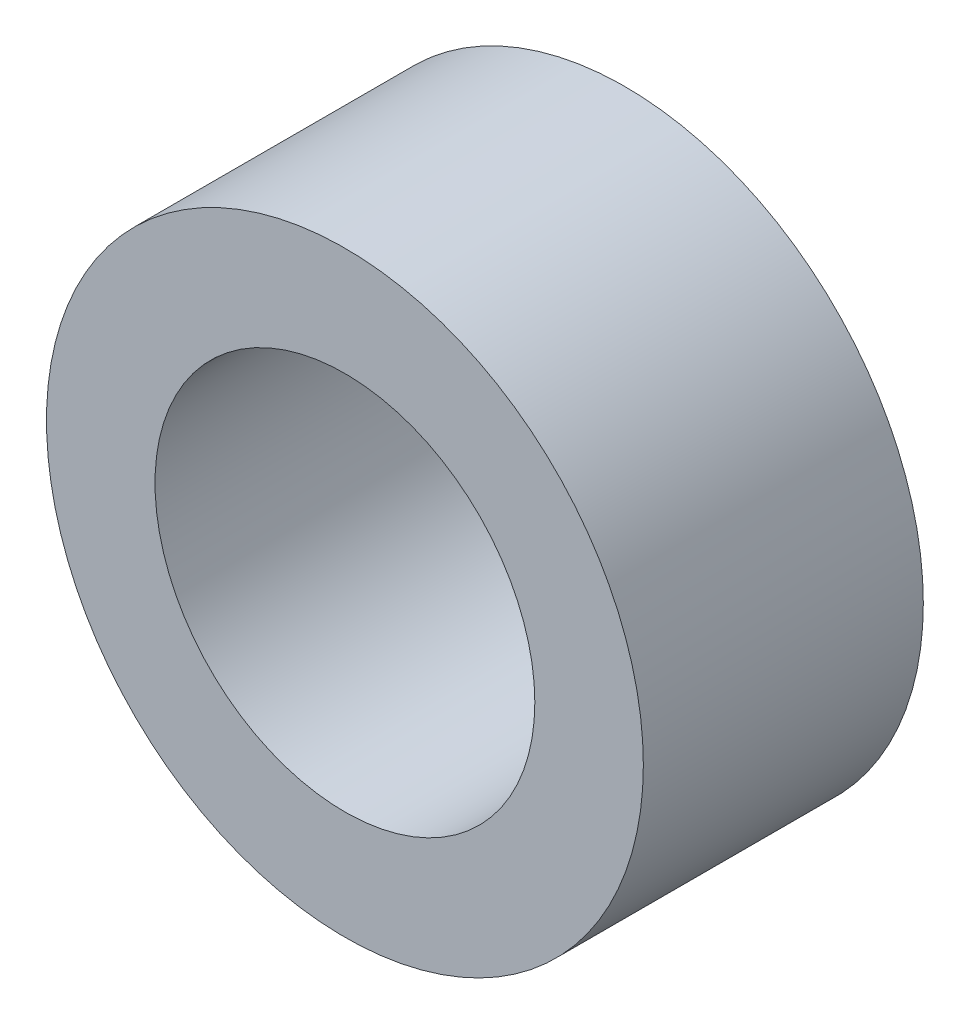
ISO-10303-21;
HEADER;
FILE_DESCRIPTION(('STEP AP214'),'2;1');
FILE_NAME('part.step','',(''),(''),'','','');
FILE_SCHEMA(('AUTOMOTIVE_DESIGN { 1 0 10303 214 1 1 1 1 }'));
ENDSEC;
DATA;
#1=APPLICATION_CONTEXT('core data for automotive mechanical design processes');
#2=APPLICATION_PROTOCOL_DEFINITION('international standard','automotive_design',2000,#1);
#3=PRODUCT_CONTEXT('',#1,'mechanical');
#4=PRODUCT('Part','Part','',(#3));
#5=PRODUCT_RELATED_PRODUCT_CATEGORY('part','',(#4));
#6=PRODUCT_DEFINITION_FORMATION('','',#4);
#7=PRODUCT_DEFINITION_CONTEXT('part definition',#1,'design');
#8=PRODUCT_DEFINITION('design','',#6,#7);
#9=PRODUCT_DEFINITION_SHAPE('','',#8);
#10=(LENGTH_UNIT() NAMED_UNIT(*) SI_UNIT(.MILLI.,.METRE.));
#11=(NAMED_UNIT(*) PLANE_ANGLE_UNIT() SI_UNIT($,.RADIAN.));
#12=(NAMED_UNIT(*) SI_UNIT($,.STERADIAN.) SOLID_ANGLE_UNIT());
#13=UNCERTAINTY_MEASURE_WITH_UNIT(LENGTH_MEASURE(1.E-05),#10,'distance_accuracy_value','');
#14=(GEOMETRIC_REPRESENTATION_CONTEXT(3) GLOBAL_UNCERTAINTY_ASSIGNED_CONTEXT((#13)) GLOBAL_UNIT_ASSIGNED_CONTEXT((#10,
#11,#12)) REPRESENTATION_CONTEXT('',''));
#15=CARTESIAN_POINT('',(0.,0.,0.));
#16=DIRECTION('',(0.,0.,1.));
#17=DIRECTION('',(1.,0.,0.));
#18=AXIS2_PLACEMENT_3D('',#15,#16,#17);
#19=CARTESIAN_POINT('',(0.,0.,12.9));
#20=DIRECTION('',(0.,0.,1.));
#21=DIRECTION('',(1.,0.,0.));
#22=AXIS2_PLACEMENT_3D('',#19,#20,#21);
#23=PLANE('',#22);
#24=CARTESIAN_POINT('',(0.,0.,12.9));
#25=DIRECTION('',(0.,0.,1.));
#26=DIRECTION('',(1.,0.,0.));
#27=AXIS2_PLACEMENT_3D('',#24,#25,#26);
#28=CIRCLE('',#27,13.75);
#29=CARTESIAN_POINT('',(13.75,0.,12.9));
#30=VERTEX_POINT('',#29);
#31=EDGE_CURVE('E10',#30,#30,#28,.T.);
#32=ORIENTED_EDGE('',*,*,#31,.T.);
#33=EDGE_LOOP('',(#32));
#34=FACE_BOUND('',#33,.T.);
#35=CARTESIAN_POINT('',(0.,0.,12.9));
#36=DIRECTION('',(0.,0.,1.));
#37=DIRECTION('',(1.,0.,0.));
#38=AXIS2_PLACEMENT_3D('',#35,#36,#37);
#39=CIRCLE('',#38,8.75);
#40=CARTESIAN_POINT('',(8.75,0.,12.9));
#41=VERTEX_POINT('',#40);
#42=EDGE_CURVE('E46',#41,#41,#39,.T.);
#43=ORIENTED_EDGE('',*,*,#42,.F.);
#44=EDGE_LOOP('',(#43));
#45=FACE_BOUND('',#44,.T.);
#46=ADVANCED_FACE('F35',(#34,#45),#23,.T.);
#47=CARTESIAN_POINT('',(0.,0.,0.));
#48=DIRECTION('',(0.,0.,1.));
#49=DIRECTION('',(1.,0.,0.));
#50=AXIS2_PLACEMENT_3D('',#47,#48,#49);
#51=PLANE('',#50);
#52=CARTESIAN_POINT('',(0.,0.,0.));
#53=DIRECTION('',(0.,0.,1.));
#54=DIRECTION('',(1.,0.,0.));
#55=AXIS2_PLACEMENT_3D('',#52,#53,#54);
#56=CIRCLE('',#55,13.75);
#57=CARTESIAN_POINT('',(13.75,0.,0.));
#58=VERTEX_POINT('',#57);
#59=EDGE_CURVE('E39',#58,#58,#56,.T.);
#60=ORIENTED_EDGE('',*,*,#59,.F.);
#61=EDGE_LOOP('',(#60));
#62=FACE_BOUND('',#61,.T.);
#63=CARTESIAN_POINT('',(0.,0.,0.));
#64=DIRECTION('',(0.,0.,1.));
#65=DIRECTION('',(1.,0.,0.));
#66=AXIS2_PLACEMENT_3D('',#63,#64,#65);
#67=CIRCLE('',#66,8.75);
#68=CARTESIAN_POINT('',(8.75,0.,0.));
#69=VERTEX_POINT('',#68);
#70=EDGE_CURVE('E48',#69,#69,#67,.T.);
#71=ORIENTED_EDGE('',*,*,#70,.T.);
#72=EDGE_LOOP('',(#71));
#73=FACE_BOUND('',#72,.T.);
#74=ADVANCED_FACE('F58',(#62,#73),#51,.F.);
#75=CARTESIAN_POINT('',(0.,0.,12.9));
#76=DIRECTION('',(0.,0.,-1.));
#77=DIRECTION('',(-1.,0.,0.));
#78=AXIS2_PLACEMENT_3D('',#75,#76,#77);
#79=CYLINDRICAL_SURFACE('',#78,13.75);
#80=ORIENTED_EDGE('',*,*,#31,.F.);
#81=EDGE_LOOP('',(#80));
#82=FACE_BOUND('',#81,.T.);
#83=ORIENTED_EDGE('',*,*,#59,.T.);
#84=EDGE_LOOP('',(#83));
#85=FACE_BOUND('',#84,.T.);
#86=ADVANCED_FACE('F37',(#82,#85),#79,.T.);
#87=CARTESIAN_POINT('',(0.,0.,12.9));
#88=DIRECTION('',(0.,0.,-1.));
#89=DIRECTION('',(-1.,0.,0.));
#90=AXIS2_PLACEMENT_3D('',#87,#88,#89);
#91=CYLINDRICAL_SURFACE('',#90,8.75);
#92=ORIENTED_EDGE('',*,*,#42,.T.);
#93=EDGE_LOOP('',(#92));
#94=FACE_BOUND('',#93,.T.);
#95=ORIENTED_EDGE('',*,*,#70,.F.);
#96=EDGE_LOOP('',(#95));
#97=FACE_BOUND('',#96,.T.);
#98=ADVANCED_FACE('F54',(#94,#97),#91,.F.);
#99=CLOSED_SHELL('',(#46,#74,#86,#98));
#100=MANIFOLD_SOLID_BREP('B2',#99);
#101=ADVANCED_BREP_SHAPE_REPRESENTATION('',(#18,#100),#14);
#102=SHAPE_DEFINITION_REPRESENTATION(#9,#101);
ENDSEC;
END-ISO-10303-21;
